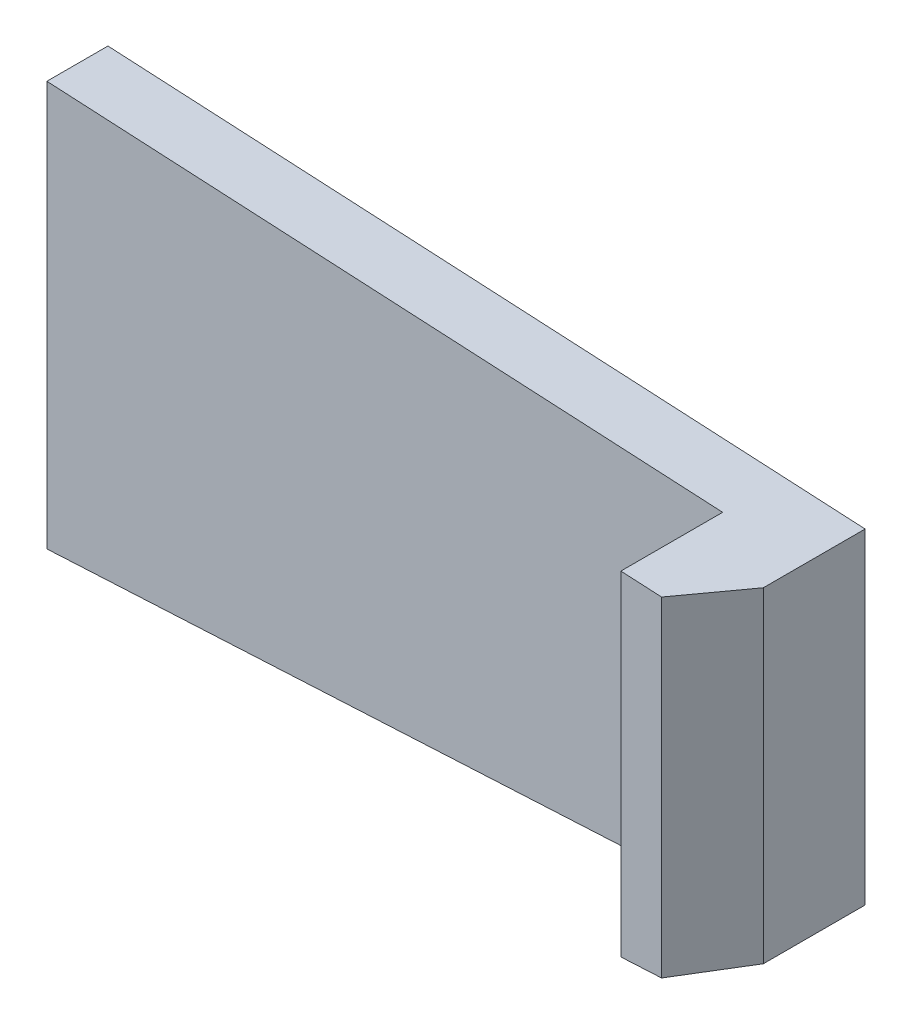
ISO-10303-21;
HEADER;
FILE_DESCRIPTION(('STEP AP214'),'2;1');
FILE_NAME('part.step','',(''),(''),'','','');
FILE_SCHEMA(('AUTOMOTIVE_DESIGN { 1 0 10303 214 1 1 1 1 }'));
ENDSEC;
DATA;
#1=APPLICATION_CONTEXT('core data for automotive mechanical design processes');
#2=APPLICATION_PROTOCOL_DEFINITION('international standard','automotive_design',2000,#1);
#3=PRODUCT_CONTEXT('',#1,'mechanical');
#4=PRODUCT('Part','Part','',(#3));
#5=PRODUCT_RELATED_PRODUCT_CATEGORY('part','',(#4));
#6=PRODUCT_DEFINITION_FORMATION('','',#4);
#7=PRODUCT_DEFINITION_CONTEXT('part definition',#1,'design');
#8=PRODUCT_DEFINITION('design','',#6,#7);
#9=PRODUCT_DEFINITION_SHAPE('','',#8);
#10=(LENGTH_UNIT() NAMED_UNIT(*) SI_UNIT(.MILLI.,.METRE.));
#11=(NAMED_UNIT(*) PLANE_ANGLE_UNIT() SI_UNIT($,.RADIAN.));
#12=(NAMED_UNIT(*) SI_UNIT($,.STERADIAN.) SOLID_ANGLE_UNIT());
#13=UNCERTAINTY_MEASURE_WITH_UNIT(LENGTH_MEASURE(1.E-05),#10,'distance_accuracy_value','');
#14=(GEOMETRIC_REPRESENTATION_CONTEXT(3) GLOBAL_UNCERTAINTY_ASSIGNED_CONTEXT((#13)) GLOBAL_UNIT_ASSIGNED_CONTEXT((#10,
#11,#12)) REPRESENTATION_CONTEXT('',''));
#15=CARTESIAN_POINT('',(0.,0.,0.));
#16=DIRECTION('',(0.,0.,1.));
#17=DIRECTION('',(1.,0.,0.));
#18=AXIS2_PLACEMENT_3D('',#15,#16,#17);
#19=CARTESIAN_POINT('',(19.3,5.29750731911594,-17.0647401915869));
#20=DIRECTION('',(0.0523359562429438,-0.998629534754574,0.));
#21=DIRECTION('',(-0.998629534754574,-0.0523359562429438,0.));
#22=AXIS2_PLACEMENT_3D('',#19,#20,#21);
#23=PLANE('',#22);
#24=DIRECTION('',(0.,0.,1.));
#25=VECTOR('',#24,1.);
#26=CARTESIAN_POINT('',(18.3,5.24509953983289,-17.0647401915869));
#27=LINE('',#26,#25);
#28=CARTESIAN_POINT('',(18.3,5.24509953983289,-16.3147401915869));
#29=VERTEX_POINT('',#28);
#30=CARTESIAN_POINT('',(18.3,5.24509953983289,-15.0647401915869));
#31=VERTEX_POINT('',#30);
#32=EDGE_CURVE('E11',#29,#31,#27,.T.);
#33=ORIENTED_EDGE('',*,*,#32,.F.);
#34=DIRECTION('',(0.998629534754574,0.0523359562429437,0.));
#35=VECTOR('',#34,1.);
#36=CARTESIAN_POINT('',(18.3,5.24509953983289,-16.3147401915869));
#37=LINE('',#36,#35);
#38=CARTESIAN_POINT('',(10.,4.81011497178365,-16.3147401915869));
#39=VERTEX_POINT('',#38);
#40=EDGE_CURVE('E145',#39,#29,#37,.T.);
#41=ORIENTED_EDGE('',*,*,#40,.F.);
#42=DIRECTION('',(0.,0.,-1.));
#43=VECTOR('',#42,1.);
#44=CARTESIAN_POINT('',(10.,4.81011497178365,-17.0647401915869));
#45=LINE('',#44,#43);
#46=CARTESIAN_POINT('',(10.,4.81011497178365,-17.0647401915869));
#47=VERTEX_POINT('',#46);
#48=EDGE_CURVE('E108',#39,#47,#45,.T.);
#49=ORIENTED_EDGE('',*,*,#48,.T.);
#50=DIRECTION('',(-0.998629534754574,-0.0523359562429438,0.));
#51=VECTOR('',#50,1.);
#52=CARTESIAN_POINT('',(19.3,5.29750731911594,-17.0647401915869));
#53=LINE('',#52,#51);
#54=CARTESIAN_POINT('',(19.3,5.29750731911594,-17.0647401915869));
#55=VERTEX_POINT('',#54);
#56=EDGE_CURVE('E36',#55,#47,#53,.T.);
#57=ORIENTED_EDGE('',*,*,#56,.F.);
#58=DIRECTION('',(0.,0.,1.));
#59=VECTOR('',#58,1.);
#60=CARTESIAN_POINT('',(19.3,5.29750731911594,-17.0647401915869));
#61=LINE('',#60,#59);
#62=CARTESIAN_POINT('',(19.3,5.29750731911594,-15.8147401915869));
#63=VERTEX_POINT('',#62);
#64=EDGE_CURVE('E111',#55,#63,#61,.T.);
#65=ORIENTED_EDGE('',*,*,#64,.T.);
#66=DIRECTION('',(0.554465956086029,0.029058329446517,-0.831698934129041));
#67=VECTOR('',#66,1.);
#68=CARTESIAN_POINT('',(19.8764359308595,5.32771704615123,-16.6793940878762));
#69=LINE('',#68,#67);
#70=CARTESIAN_POINT('',(18.8,5.27130342947441,-15.0647401915869));
#71=VERTEX_POINT('',#70);
#72=EDGE_CURVE('E126',#71,#63,#69,.T.);
#73=ORIENTED_EDGE('',*,*,#72,.F.);
#74=DIRECTION('',(-0.998629534754574,-0.0523359562429438,0.));
#75=VECTOR('',#74,1.);
#76=CARTESIAN_POINT('',(19.3,5.29750731911594,-15.0647401915869));
#77=LINE('',#76,#75);
#78=EDGE_CURVE('E106',#71,#31,#77,.T.);
#79=ORIENTED_EDGE('',*,*,#78,.T.);
#80=EDGE_LOOP('',(#33,#41,#49,#57,#65,#73,#79));
#81=FACE_BOUND('',#80,.T.);
#82=ADVANCED_FACE('F33',(#81),#23,.T.);
#83=CARTESIAN_POINT('',(19.3,7.29750731911594,-17.0647401915869));
#84=DIRECTION('',(0.,0.,-1.));
#85=DIRECTION('',(0.,-1.,0.));
#86=AXIS2_PLACEMENT_3D('',#83,#84,#85);
#87=PLANE('',#86);
#88=ORIENTED_EDGE('',*,*,#56,.T.);
#89=DIRECTION('',(0.,1.,0.));
#90=VECTOR('',#89,1.);
#91=CARTESIAN_POINT('',(10.,7.29750731911594,-17.0647401915869));
#92=LINE('',#91,#90);
#93=CARTESIAN_POINT('',(10.,9.78489966644822,-17.0647401915869));
#94=VERTEX_POINT('',#93);
#95=EDGE_CURVE('E113',#47,#94,#92,.T.);
#96=ORIENTED_EDGE('',*,*,#95,.T.);
#97=DIRECTION('',(0.998629534754574,-0.0523359562429438,0.));
#98=VECTOR('',#97,1.);
#99=CARTESIAN_POINT('',(19.3,9.29750731911594,-17.0647401915869));
#100=LINE('',#99,#98);
#101=CARTESIAN_POINT('',(19.3,9.29750731911594,-17.0647401915869));
#102=VERTEX_POINT('',#101);
#103=EDGE_CURVE('E115',#94,#102,#100,.T.);
#104=ORIENTED_EDGE('',*,*,#103,.T.);
#105=DIRECTION('',(0.,-1.,0.));
#106=VECTOR('',#105,1.);
#107=CARTESIAN_POINT('',(19.3,7.29750731911594,-17.0647401915869));
#108=LINE('',#107,#106);
#109=EDGE_CURVE('E116',#102,#55,#108,.T.);
#110=ORIENTED_EDGE('',*,*,#109,.T.);
#111=EDGE_LOOP('',(#88,#96,#104,#110));
#112=FACE_BOUND('',#111,.T.);
#113=ADVANCED_FACE('F138',(#112),#87,.T.);
#114=CARTESIAN_POINT('',(19.3,9.29750731911594,-17.0647401915869));
#115=DIRECTION('',(0.0523359562429438,0.998629534754574,0.));
#116=DIRECTION('',(0.998629534754574,-0.0523359562429438,0.));
#117=AXIS2_PLACEMENT_3D('',#114,#115,#116);
#118=PLANE('',#117);
#119=DIRECTION('',(-0.998629534754574,0.0523359562429437,0.));
#120=VECTOR('',#119,1.);
#121=CARTESIAN_POINT('',(10.,9.78489966644822,-16.3147401915869));
#122=LINE('',#121,#120);
#123=CARTESIAN_POINT('',(18.3,9.34991509839898,-16.3147401915869));
#124=VERTEX_POINT('',#123);
#125=CARTESIAN_POINT('',(10.,9.78489966644822,-16.3147401915869));
#126=VERTEX_POINT('',#125);
#127=EDGE_CURVE('E49',#124,#126,#122,.T.);
#128=ORIENTED_EDGE('',*,*,#127,.F.);
#129=DIRECTION('',(0.,0.,1.));
#130=VECTOR('',#129,1.);
#131=CARTESIAN_POINT('',(18.3,9.34991509839898,-15.8147401915869));
#132=LINE('',#131,#130);
#133=CARTESIAN_POINT('',(18.3,9.34991509839898,-15.0647401915869));
#134=VERTEX_POINT('',#133);
#135=EDGE_CURVE('E85',#124,#134,#132,.T.);
#136=ORIENTED_EDGE('',*,*,#135,.T.);
#137=DIRECTION('',(0.998629534754574,-0.0523359562429438,0.));
#138=VECTOR('',#137,1.);
#139=CARTESIAN_POINT('',(19.3,9.29750731911594,-15.0647401915869));
#140=LINE('',#139,#138);
#141=CARTESIAN_POINT('',(18.8,9.32371120875746,-15.0647401915869));
#142=VERTEX_POINT('',#141);
#143=EDGE_CURVE('E93',#134,#142,#140,.T.);
#144=ORIENTED_EDGE('',*,*,#143,.T.);
#145=DIRECTION('',(-0.554465956086029,0.029058329446517,0.831698934129041));
#146=VECTOR('',#145,1.);
#147=CARTESIAN_POINT('',(19.8764359308595,9.26729759208064,-16.6793940878762));
#148=LINE('',#147,#146);
#149=CARTESIAN_POINT('',(19.3,9.29750731911594,-15.8147401915869));
#150=VERTEX_POINT('',#149);
#151=EDGE_CURVE('E88',#150,#142,#148,.T.);
#152=ORIENTED_EDGE('',*,*,#151,.F.);
#153=DIRECTION('',(0.,0.,1.));
#154=VECTOR('',#153,1.);
#155=CARTESIAN_POINT('',(19.3,9.29750731911594,-17.0647401915869));
#156=LINE('',#155,#154);
#157=EDGE_CURVE('E100',#102,#150,#156,.T.);
#158=ORIENTED_EDGE('',*,*,#157,.F.);
#159=ORIENTED_EDGE('',*,*,#103,.F.);
#160=DIRECTION('',(0.,0.,1.));
#161=VECTOR('',#160,1.);
#162=CARTESIAN_POINT('',(10.,9.78489966644822,-17.0647401915869));
#163=LINE('',#162,#161);
#164=EDGE_CURVE('E95',#94,#126,#163,.T.);
#165=ORIENTED_EDGE('',*,*,#164,.T.);
#166=EDGE_LOOP('',(#128,#136,#144,#152,#158,#159,#165));
#167=FACE_BOUND('',#166,.T.);
#168=ADVANCED_FACE('F92',(#167),#118,.T.);
#169=CARTESIAN_POINT('',(19.3,7.29750731911594,-17.0647401915869));
#170=DIRECTION('',(1.,0.,0.));
#171=DIRECTION('',(0.,0.,1.));
#172=AXIS2_PLACEMENT_3D('',#169,#170,#171);
#173=PLANE('',#172);
#174=ORIENTED_EDGE('',*,*,#64,.F.);
#175=ORIENTED_EDGE('',*,*,#109,.F.);
#176=ORIENTED_EDGE('',*,*,#157,.T.);
#177=DIRECTION('',(0.,1.,0.));
#178=VECTOR('',#177,1.);
#179=CARTESIAN_POINT('',(19.3,7.29750731911594,-15.8147401915869));
#180=LINE('',#179,#178);
#181=EDGE_CURVE('E130',#63,#150,#180,.T.);
#182=ORIENTED_EDGE('',*,*,#181,.F.);
#183=EDGE_LOOP('',(#174,#175,#176,#182));
#184=FACE_BOUND('',#183,.T.);
#185=ADVANCED_FACE('F151',(#184),#173,.T.);
#186=CARTESIAN_POINT('',(19.3,7.29750731911594,-15.8147401915869));
#187=DIRECTION('',(0.832050294337843,0.,0.55470019622523));
#188=DIRECTION('',(-0.55470019622523,0.,0.832050294337843));
#189=AXIS2_PLACEMENT_3D('',#186,#187,#188);
#190=PLANE('',#189);
#191=DIRECTION('',(0.,-1.,0.));
#192=VECTOR('',#191,1.);
#193=CARTESIAN_POINT('',(18.8,7.29750731911594,-15.0647401915869));
#194=LINE('',#193,#192);
#195=EDGE_CURVE('E98',#142,#71,#194,.T.);
#196=ORIENTED_EDGE('',*,*,#195,.T.);
#197=ORIENTED_EDGE('',*,*,#72,.T.);
#198=ORIENTED_EDGE('',*,*,#181,.T.);
#199=ORIENTED_EDGE('',*,*,#151,.T.);
#200=EDGE_LOOP('',(#196,#197,#198,#199));
#201=FACE_BOUND('',#200,.T.);
#202=ADVANCED_FACE('F152',(#201),#190,.T.);
#203=CARTESIAN_POINT('',(18.3,7.29750731911594,-15.8147401915869));
#204=DIRECTION('',(-1.,0.,0.));
#205=DIRECTION('',(0.,0.,-1.));
#206=AXIS2_PLACEMENT_3D('',#203,#204,#205);
#207=PLANE('',#206);
#208=DIRECTION('',(0.,1.,0.));
#209=VECTOR('',#208,1.);
#210=CARTESIAN_POINT('',(18.3,7.29750731911594,-15.0647401915869));
#211=LINE('',#210,#209);
#212=EDGE_CURVE('E41',#31,#134,#211,.T.);
#213=ORIENTED_EDGE('',*,*,#212,.T.);
#214=ORIENTED_EDGE('',*,*,#135,.F.);
#215=DIRECTION('',(0.,1.,0.));
#216=VECTOR('',#215,1.);
#217=CARTESIAN_POINT('',(18.3,9.34991509839898,-16.3147401915869));
#218=LINE('',#217,#216);
#219=EDGE_CURVE('E112',#29,#124,#218,.T.);
#220=ORIENTED_EDGE('',*,*,#219,.F.);
#221=ORIENTED_EDGE('',*,*,#32,.T.);
#222=EDGE_LOOP('',(#213,#214,#220,#221));
#223=FACE_BOUND('',#222,.T.);
#224=ADVANCED_FACE('F82',(#223),#207,.T.);
#225=CARTESIAN_POINT('',(18.3,7.29750731911594,-15.0647401915869));
#226=DIRECTION('',(0.,0.,-1.));
#227=DIRECTION('',(0.,-1.,0.));
#228=AXIS2_PLACEMENT_3D('',#225,#226,#227);
#229=PLANE('',#228);
#230=ORIENTED_EDGE('',*,*,#195,.F.);
#231=ORIENTED_EDGE('',*,*,#143,.F.);
#232=ORIENTED_EDGE('',*,*,#212,.F.);
#233=ORIENTED_EDGE('',*,*,#78,.F.);
#234=EDGE_LOOP('',(#230,#231,#232,#233));
#235=FACE_BOUND('',#234,.T.);
#236=ADVANCED_FACE('F97',(#235),#229,.F.);
#237=CARTESIAN_POINT('',(10.,0.,0.));
#238=DIRECTION('',(-1.,0.,0.));
#239=DIRECTION('',(0.,0.,1.));
#240=AXIS2_PLACEMENT_3D('',#237,#238,#239);
#241=PLANE('',#240);
#242=DIRECTION('',(0.,-1.,0.));
#243=VECTOR('',#242,1.);
#244=CARTESIAN_POINT('',(10.,4.81011497178365,-16.3147401915869));
#245=LINE('',#244,#243);
#246=EDGE_CURVE('E149',#126,#39,#245,.T.);
#247=ORIENTED_EDGE('',*,*,#246,.F.);
#248=ORIENTED_EDGE('',*,*,#164,.F.);
#249=ORIENTED_EDGE('',*,*,#95,.F.);
#250=ORIENTED_EDGE('',*,*,#48,.F.);
#251=EDGE_LOOP('',(#247,#248,#249,#250));
#252=FACE_BOUND('',#251,.T.);
#253=ADVANCED_FACE('F148',(#252),#241,.T.);
#254=CARTESIAN_POINT('',(0.,0.,-16.3147401915869));
#255=DIRECTION('',(0.,0.,-1.));
#256=DIRECTION('',(-1.,0.,0.));
#257=AXIS2_PLACEMENT_3D('',#254,#255,#256);
#258=PLANE('',#257);
#259=ORIENTED_EDGE('',*,*,#127,.T.);
#260=ORIENTED_EDGE('',*,*,#246,.T.);
#261=ORIENTED_EDGE('',*,*,#40,.T.);
#262=ORIENTED_EDGE('',*,*,#219,.T.);
#263=EDGE_LOOP('',(#259,#260,#261,#262));
#264=FACE_BOUND('',#263,.T.);
#265=ADVANCED_FACE('F174',(#264),#258,.F.);
#266=CLOSED_SHELL('',(#82,#113,#168,#185,#202,#224,#236,#253,#265));
#267=MANIFOLD_SOLID_BREP('B2',#266);
#268=ADVANCED_BREP_SHAPE_REPRESENTATION('',(#18,#267),#14);
#269=SHAPE_DEFINITION_REPRESENTATION(#9,#268);
ENDSEC;
END-ISO-10303-21;
